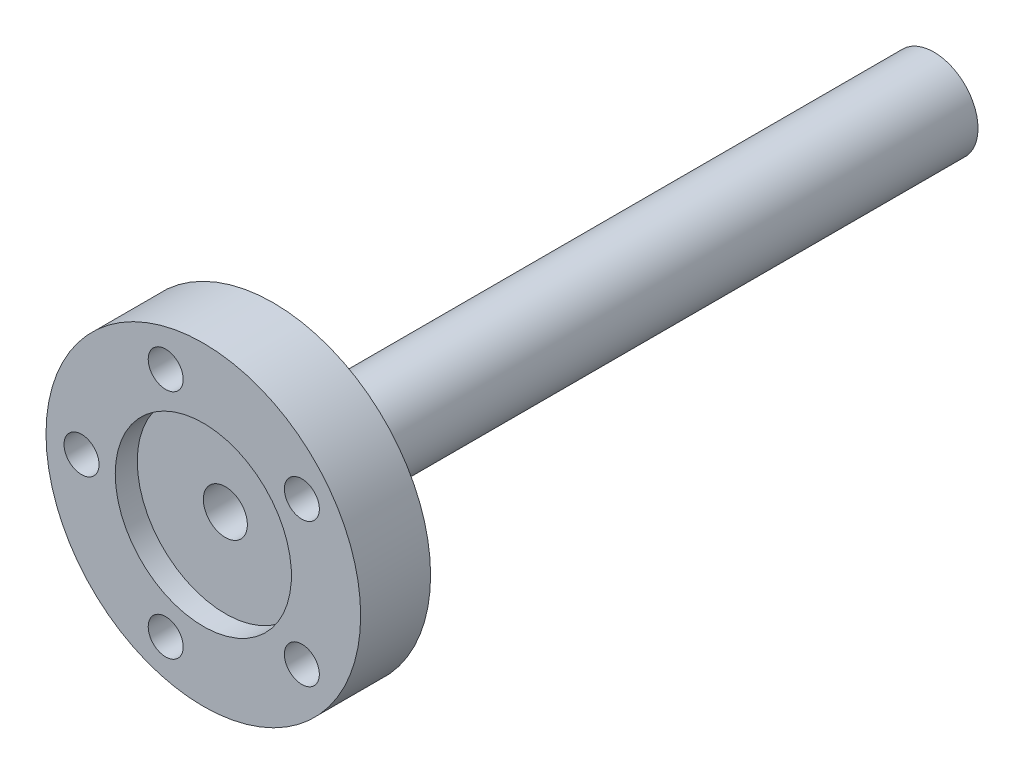
ISO-10303-21;
HEADER;
FILE_DESCRIPTION(('STEP AP214'),'2;1');
FILE_NAME('part.step','',(''),(''),'','','');
FILE_SCHEMA(('AUTOMOTIVE_DESIGN { 1 0 10303 214 1 1 1 1 }'));
ENDSEC;
DATA;
#1=APPLICATION_CONTEXT('core data for automotive mechanical design processes');
#2=APPLICATION_PROTOCOL_DEFINITION('international standard','automotive_design',2000,#1);
#3=PRODUCT_CONTEXT('',#1,'mechanical');
#4=PRODUCT('Part','Part','',(#3));
#5=PRODUCT_RELATED_PRODUCT_CATEGORY('part','',(#4));
#6=PRODUCT_DEFINITION_FORMATION('','',#4);
#7=PRODUCT_DEFINITION_CONTEXT('part definition',#1,'design');
#8=PRODUCT_DEFINITION('design','',#6,#7);
#9=PRODUCT_DEFINITION_SHAPE('','',#8);
#10=(LENGTH_UNIT() NAMED_UNIT(*) SI_UNIT(.MILLI.,.METRE.));
#11=(NAMED_UNIT(*) PLANE_ANGLE_UNIT() SI_UNIT($,.RADIAN.));
#12=(NAMED_UNIT(*) SI_UNIT($,.STERADIAN.) SOLID_ANGLE_UNIT());
#13=UNCERTAINTY_MEASURE_WITH_UNIT(LENGTH_MEASURE(1.E-05),#10,'distance_accuracy_value','');
#14=(GEOMETRIC_REPRESENTATION_CONTEXT(3) GLOBAL_UNCERTAINTY_ASSIGNED_CONTEXT((#13)) GLOBAL_UNIT_ASSIGNED_CONTEXT((#10,
#11,#12)) REPRESENTATION_CONTEXT('',''));
#15=CARTESIAN_POINT('',(0.,0.,0.));
#16=DIRECTION('',(0.,0.,1.));
#17=DIRECTION('',(1.,0.,0.));
#18=AXIS2_PLACEMENT_3D('',#15,#16,#17);
#19=CARTESIAN_POINT('',(0.,0.,-5.));
#20=DIRECTION('',(0.,0.,-1.));
#21=DIRECTION('',(-1.,0.,0.));
#22=AXIS2_PLACEMENT_3D('',#19,#20,#21);
#23=PLANE('',#22);
#24=CARTESIAN_POINT('',(0.,0.,-5.));
#25=DIRECTION('',(0.,0.,-1.));
#26=DIRECTION('',(-1.,0.,0.));
#27=AXIS2_PLACEMENT_3D('',#24,#25,#26);
#28=CIRCLE('',#27,2.);
#29=CARTESIAN_POINT('',(-2.,0.,-5.));
#30=VERTEX_POINT('',#29);
#31=EDGE_CURVE('E20',#30,#30,#28,.F.);
#32=ORIENTED_EDGE('',*,*,#31,.T.);
#33=EDGE_LOOP('',(#32));
#34=FACE_BOUND('',#33,.T.);
#35=ADVANCED_FACE('F17',(#34),#23,.F.);
#36=CARTESIAN_POINT('',(0.,0.,-2.));
#37=DIRECTION('',(0.,0.,-1.));
#38=DIRECTION('',(-1.,0.,0.));
#39=AXIS2_PLACEMENT_3D('',#36,#37,#38);
#40=CYLINDRICAL_SURFACE('',#39,2.);
#41=CARTESIAN_POINT('',(0.,0.,-2.));
#42=DIRECTION('',(0.,0.,-1.));
#43=DIRECTION('',(-1.,0.,0.));
#44=AXIS2_PLACEMENT_3D('',#41,#42,#43);
#45=CIRCLE('',#44,2.);
#46=CARTESIAN_POINT('',(-2.,0.,-2.));
#47=VERTEX_POINT('',#46);
#48=EDGE_CURVE('E308',#47,#47,#45,.F.);
#49=ORIENTED_EDGE('',*,*,#48,.T.);
#50=EDGE_LOOP('',(#49));
#51=FACE_BOUND('',#50,.T.);
#52=ORIENTED_EDGE('',*,*,#31,.F.);
#53=EDGE_LOOP('',(#52));
#54=FACE_BOUND('',#53,.T.);
#55=ADVANCED_FACE('F185',(#51,#54),#40,.F.);
#56=CARTESIAN_POINT('',(0.,0.,-2.));
#57=DIRECTION('',(0.,0.,-1.));
#58=DIRECTION('',(-1.,0.,0.));
#59=AXIS2_PLACEMENT_3D('',#56,#57,#58);
#60=PLANE('',#59);
#61=CARTESIAN_POINT('',(0.,0.,-2.));
#62=DIRECTION('',(0.,0.,-1.));
#63=DIRECTION('',(-1.,0.,0.));
#64=AXIS2_PLACEMENT_3D('',#61,#62,#63);
#65=CIRCLE('',#64,8.);
#66=CARTESIAN_POINT('',(-8.,0.,-2.));
#67=VERTEX_POINT('',#66);
#68=EDGE_CURVE('E306',#67,#67,#65,.F.);
#69=ORIENTED_EDGE('',*,*,#68,.T.);
#70=EDGE_LOOP('',(#69));
#71=FACE_BOUND('',#70,.T.);
#72=ORIENTED_EDGE('',*,*,#48,.F.);
#73=EDGE_LOOP('',(#72));
#74=FACE_BOUND('',#73,.T.);
#75=ADVANCED_FACE('F182',(#71,#74),#60,.F.);
#76=CARTESIAN_POINT('',(0.,0.,0.));
#77=DIRECTION('',(0.,0.,-1.));
#78=DIRECTION('',(-1.,0.,0.));
#79=AXIS2_PLACEMENT_3D('',#76,#77,#78);
#80=CYLINDRICAL_SURFACE('',#79,8.);
#81=CARTESIAN_POINT('',(0.,0.,0.));
#82=DIRECTION('',(0.,0.,-1.));
#83=DIRECTION('',(-1.,0.,0.));
#84=AXIS2_PLACEMENT_3D('',#81,#82,#83);
#85=CIRCLE('',#84,8.);
#86=CARTESIAN_POINT('',(-8.,0.,0.));
#87=VERTEX_POINT('',#86);
#88=EDGE_CURVE('E303',#87,#87,#85,.F.);
#89=ORIENTED_EDGE('',*,*,#88,.T.);
#90=EDGE_LOOP('',(#89));
#91=FACE_BOUND('',#90,.T.);
#92=ORIENTED_EDGE('',*,*,#68,.F.);
#93=EDGE_LOOP('',(#92));
#94=FACE_BOUND('',#93,.T.);
#95=ADVANCED_FACE('F178',(#91,#94),#80,.F.);
#96=CARTESIAN_POINT('',(-3.41772795778692,10.5186850702244,0.));
#97=DIRECTION('',(0.,0.,-1.));
#98=DIRECTION('',(-1.,0.,0.));
#99=AXIS2_PLACEMENT_3D('',#96,#97,#98);
#100=CYLINDRICAL_SURFACE('',#99,1.5875);
#101=CARTESIAN_POINT('',(-3.41772795778692,10.5186850702244,0.));
#102=DIRECTION('',(0.,0.,-1.));
#103=DIRECTION('',(-1.,0.,0.));
#104=AXIS2_PLACEMENT_3D('',#101,#102,#103);
#105=CIRCLE('',#104,1.5875);
#106=CARTESIAN_POINT('',(-5.00522795778692,10.5186850702244,0.));
#107=VERTEX_POINT('',#106);
#108=EDGE_CURVE('E291',#107,#107,#105,.F.);
#109=ORIENTED_EDGE('',*,*,#108,.T.);
#110=EDGE_LOOP('',(#109));
#111=FACE_BOUND('',#110,.T.);
#112=CARTESIAN_POINT('',(-3.41772795778692,10.5186850702244,-4.7625));
#113=DIRECTION('',(0.,0.,-1.));
#114=DIRECTION('',(-1.,0.,0.));
#115=AXIS2_PLACEMENT_3D('',#112,#113,#114);
#116=CIRCLE('',#115,1.5875);
#117=CARTESIAN_POINT('',(-5.00522795778692,10.5186850702244,-4.7625));
#118=VERTEX_POINT('',#117);
#119=EDGE_CURVE('E285',#118,#118,#116,.T.);
#120=ORIENTED_EDGE('',*,*,#119,.T.);
#121=EDGE_LOOP('',(#120));
#122=FACE_BOUND('',#121,.T.);
#123=ADVANCED_FACE('F174',(#111,#122),#100,.F.);
#124=CARTESIAN_POINT('',(8.94772795778692,6.50090489035475,0.));
#125=DIRECTION('',(0.,0.,-1.));
#126=DIRECTION('',(-1.,0.,0.));
#127=AXIS2_PLACEMENT_3D('',#124,#125,#126);
#128=CYLINDRICAL_SURFACE('',#127,1.5875);
#129=CARTESIAN_POINT('',(8.94772795778692,6.50090489035475,0.));
#130=DIRECTION('',(0.,0.,-1.));
#131=DIRECTION('',(-1.,0.,0.));
#132=AXIS2_PLACEMENT_3D('',#129,#130,#131);
#133=CIRCLE('',#132,1.5875);
#134=CARTESIAN_POINT('',(7.36022795778692,6.50090489035475,0.));
#135=VERTEX_POINT('',#134);
#136=EDGE_CURVE('E294',#135,#135,#133,.F.);
#137=ORIENTED_EDGE('',*,*,#136,.T.);
#138=EDGE_LOOP('',(#137));
#139=FACE_BOUND('',#138,.T.);
#140=CARTESIAN_POINT('',(8.94772795778692,6.50090489035475,-4.7625));
#141=DIRECTION('',(0.,0.,-1.));
#142=DIRECTION('',(-1.,0.,0.));
#143=AXIS2_PLACEMENT_3D('',#140,#141,#142);
#144=CIRCLE('',#143,1.5875);
#145=CARTESIAN_POINT('',(7.36022795778692,6.50090489035475,-4.7625));
#146=VERTEX_POINT('',#145);
#147=EDGE_CURVE('E282',#146,#146,#144,.T.);
#148=ORIENTED_EDGE('',*,*,#147,.T.);
#149=EDGE_LOOP('',(#148));
#150=FACE_BOUND('',#149,.T.);
#151=ADVANCED_FACE('F170',(#139,#150),#128,.F.);
#152=CARTESIAN_POINT('',(8.94772795778692,-6.50090489035475,0.));
#153=DIRECTION('',(0.,0.,-1.));
#154=DIRECTION('',(-1.,0.,0.));
#155=AXIS2_PLACEMENT_3D('',#152,#153,#154);
#156=CYLINDRICAL_SURFACE('',#155,1.5875);
#157=CARTESIAN_POINT('',(8.94772795778692,-6.50090489035475,0.));
#158=DIRECTION('',(0.,0.,-1.));
#159=DIRECTION('',(-1.,0.,0.));
#160=AXIS2_PLACEMENT_3D('',#157,#158,#159);
#161=CIRCLE('',#160,1.5875);
#162=CARTESIAN_POINT('',(7.36022795778692,-6.50090489035475,0.));
#163=VERTEX_POINT('',#162);
#164=EDGE_CURVE('E297',#163,#163,#161,.F.);
#165=ORIENTED_EDGE('',*,*,#164,.T.);
#166=EDGE_LOOP('',(#165));
#167=FACE_BOUND('',#166,.T.);
#168=CARTESIAN_POINT('',(8.94772795778692,-6.50090489035475,-4.7625));
#169=DIRECTION('',(0.,0.,-1.));
#170=DIRECTION('',(-1.,0.,0.));
#171=AXIS2_PLACEMENT_3D('',#168,#169,#170);
#172=CIRCLE('',#171,1.5875);
#173=CARTESIAN_POINT('',(7.36022795778692,-6.50090489035475,-4.7625));
#174=VERTEX_POINT('',#173);
#175=EDGE_CURVE('E279',#174,#174,#172,.T.);
#176=ORIENTED_EDGE('',*,*,#175,.T.);
#177=EDGE_LOOP('',(#176));
#178=FACE_BOUND('',#177,.T.);
#179=ADVANCED_FACE('F166',(#167,#178),#156,.F.);
#180=CARTESIAN_POINT('',(-3.41772795778692,-10.5186850702244,0.));
#181=DIRECTION('',(0.,0.,-1.));
#182=DIRECTION('',(-1.,0.,0.));
#183=AXIS2_PLACEMENT_3D('',#180,#181,#182);
#184=CYLINDRICAL_SURFACE('',#183,1.5875);
#185=CARTESIAN_POINT('',(-3.41772795778692,-10.5186850702244,0.));
#186=DIRECTION('',(0.,0.,-1.));
#187=DIRECTION('',(-1.,0.,0.));
#188=AXIS2_PLACEMENT_3D('',#185,#186,#187);
#189=CIRCLE('',#188,1.5875);
#190=CARTESIAN_POINT('',(-5.00522795778692,-10.5186850702244,0.));
#191=VERTEX_POINT('',#190);
#192=EDGE_CURVE('E300',#191,#191,#189,.F.);
#193=ORIENTED_EDGE('',*,*,#192,.T.);
#194=EDGE_LOOP('',(#193));
#195=FACE_BOUND('',#194,.T.);
#196=CARTESIAN_POINT('',(-3.41772795778692,-10.5186850702244,-4.7625));
#197=DIRECTION('',(0.,0.,-1.));
#198=DIRECTION('',(-1.,0.,0.));
#199=AXIS2_PLACEMENT_3D('',#196,#197,#198);
#200=CIRCLE('',#199,1.5875);
#201=CARTESIAN_POINT('',(-5.00522795778692,-10.5186850702244,-4.7625));
#202=VERTEX_POINT('',#201);
#203=EDGE_CURVE('E276',#202,#202,#200,.T.);
#204=ORIENTED_EDGE('',*,*,#203,.T.);
#205=EDGE_LOOP('',(#204));
#206=FACE_BOUND('',#205,.T.);
#207=ADVANCED_FACE('F162',(#195,#206),#184,.F.);
#208=CARTESIAN_POINT('',(-11.06,0.,0.));
#209=DIRECTION('',(0.,0.,-1.));
#210=DIRECTION('',(-1.,0.,0.));
#211=AXIS2_PLACEMENT_3D('',#208,#209,#210);
#212=CYLINDRICAL_SURFACE('',#211,1.5875);
#213=CARTESIAN_POINT('',(-11.06,0.,0.));
#214=DIRECTION('',(0.,0.,-1.));
#215=DIRECTION('',(-1.,0.,0.));
#216=AXIS2_PLACEMENT_3D('',#213,#214,#215);
#217=CIRCLE('',#216,1.5875);
#218=CARTESIAN_POINT('',(-12.6475,0.,0.));
#219=VERTEX_POINT('',#218);
#220=EDGE_CURVE('E288',#219,#219,#217,.F.);
#221=ORIENTED_EDGE('',*,*,#220,.T.);
#222=EDGE_LOOP('',(#221));
#223=FACE_BOUND('',#222,.T.);
#224=CARTESIAN_POINT('',(-11.06,0.,-4.7625));
#225=DIRECTION('',(0.,0.,-1.));
#226=DIRECTION('',(-1.,0.,0.));
#227=AXIS2_PLACEMENT_3D('',#224,#225,#226);
#228=CIRCLE('',#227,1.5875);
#229=CARTESIAN_POINT('',(-12.6475,0.,-4.7625));
#230=VERTEX_POINT('',#229);
#231=EDGE_CURVE('E273',#230,#230,#228,.T.);
#232=ORIENTED_EDGE('',*,*,#231,.T.);
#233=EDGE_LOOP('',(#232));
#234=FACE_BOUND('',#233,.T.);
#235=ADVANCED_FACE('F158',(#223,#234),#212,.F.);
#236=CARTESIAN_POINT('',(0.,0.,0.));
#237=DIRECTION('',(0.,0.,-1.));
#238=DIRECTION('',(-1.,0.,0.));
#239=AXIS2_PLACEMENT_3D('',#236,#237,#238);
#240=PLANE('',#239);
#241=CARTESIAN_POINT('',(0.,0.,0.));
#242=DIRECTION('',(0.,0.,1.));
#243=DIRECTION('',(1.,0.,0.));
#244=AXIS2_PLACEMENT_3D('',#241,#242,#243);
#245=CIRCLE('',#244,14.2875);
#246=CARTESIAN_POINT('',(14.2875,0.,0.));
#247=VERTEX_POINT('',#246);
#248=EDGE_CURVE('E270',#247,#247,#245,.F.);
#249=ORIENTED_EDGE('',*,*,#248,.F.);
#250=EDGE_LOOP('',(#249));
#251=FACE_BOUND('',#250,.T.);
#252=ORIENTED_EDGE('',*,*,#220,.F.);
#253=EDGE_LOOP('',(#252));
#254=FACE_BOUND('',#253,.T.);
#255=ORIENTED_EDGE('',*,*,#108,.F.);
#256=EDGE_LOOP('',(#255));
#257=FACE_BOUND('',#256,.T.);
#258=ORIENTED_EDGE('',*,*,#136,.F.);
#259=EDGE_LOOP('',(#258));
#260=FACE_BOUND('',#259,.T.);
#261=ORIENTED_EDGE('',*,*,#164,.F.);
#262=EDGE_LOOP('',(#261));
#263=FACE_BOUND('',#262,.T.);
#264=ORIENTED_EDGE('',*,*,#192,.F.);
#265=EDGE_LOOP('',(#264));
#266=FACE_BOUND('',#265,.T.);
#267=ORIENTED_EDGE('',*,*,#88,.F.);
#268=EDGE_LOOP('',(#267));
#269=FACE_BOUND('',#268,.T.);
#270=ADVANCED_FACE('F154',(#251,#254,#257,#260,#263,#266,#269),#240,.F.);
#271=CARTESIAN_POINT('',(-3.41772795778692,10.5186850702244,-4.7625));
#272=DIRECTION('',(0.,0.,-1.));
#273=DIRECTION('',(-1.,0.,0.));
#274=AXIS2_PLACEMENT_3D('',#271,#272,#273);
#275=PLANE('',#274);
#276=ORIENTED_EDGE('',*,*,#119,.F.);
#277=EDGE_LOOP('',(#276));
#278=FACE_BOUND('',#277,.T.);
#279=CARTESIAN_POINT('',(-3.41772795778692,10.5186850702244,-4.7625));
#280=DIRECTION('',(0.,0.,1.));
#281=DIRECTION('',(1.,0.,0.));
#282=AXIS2_PLACEMENT_3D('',#279,#280,#281);
#283=CIRCLE('',#282,1.0922);
#284=CARTESIAN_POINT('',(-2.32552795778692,10.5186850702244,-4.7625));
#285=VERTEX_POINT('',#284);
#286=EDGE_CURVE('E267',#285,#285,#283,.F.);
#287=ORIENTED_EDGE('',*,*,#286,.T.);
#288=EDGE_LOOP('',(#287));
#289=FACE_BOUND('',#288,.T.);
#290=ADVANCED_FACE('F150',(#278,#289),#275,.F.);
#291=CARTESIAN_POINT('',(8.94772795778692,6.50090489035475,-4.7625));
#292=DIRECTION('',(0.,0.,-1.));
#293=DIRECTION('',(-1.,0.,0.));
#294=AXIS2_PLACEMENT_3D('',#291,#292,#293);
#295=PLANE('',#294);
#296=ORIENTED_EDGE('',*,*,#147,.F.);
#297=EDGE_LOOP('',(#296));
#298=FACE_BOUND('',#297,.T.);
#299=CARTESIAN_POINT('',(8.94772795778692,6.50090489035475,-4.7625));
#300=DIRECTION('',(0.,0.,1.));
#301=DIRECTION('',(1.,0.,0.));
#302=AXIS2_PLACEMENT_3D('',#299,#300,#301);
#303=CIRCLE('',#302,1.0922);
#304=CARTESIAN_POINT('',(10.0399279577869,6.50090489035475,-4.7625));
#305=VERTEX_POINT('',#304);
#306=EDGE_CURVE('E264',#305,#305,#303,.F.);
#307=ORIENTED_EDGE('',*,*,#306,.T.);
#308=EDGE_LOOP('',(#307));
#309=FACE_BOUND('',#308,.T.);
#310=ADVANCED_FACE('F146',(#298,#309),#295,.F.);
#311=CARTESIAN_POINT('',(8.94772795778692,-6.50090489035475,-4.7625));
#312=DIRECTION('',(0.,0.,-1.));
#313=DIRECTION('',(-1.,0.,0.));
#314=AXIS2_PLACEMENT_3D('',#311,#312,#313);
#315=PLANE('',#314);
#316=ORIENTED_EDGE('',*,*,#175,.F.);
#317=EDGE_LOOP('',(#316));
#318=FACE_BOUND('',#317,.T.);
#319=CARTESIAN_POINT('',(8.94772795778692,-6.50090489035475,-4.7625));
#320=DIRECTION('',(0.,0.,1.));
#321=DIRECTION('',(1.,0.,0.));
#322=AXIS2_PLACEMENT_3D('',#319,#320,#321);
#323=CIRCLE('',#322,1.0922);
#324=CARTESIAN_POINT('',(10.0399279577869,-6.50090489035475,-4.7625));
#325=VERTEX_POINT('',#324);
#326=EDGE_CURVE('E261',#325,#325,#323,.F.);
#327=ORIENTED_EDGE('',*,*,#326,.T.);
#328=EDGE_LOOP('',(#327));
#329=FACE_BOUND('',#328,.T.);
#330=ADVANCED_FACE('F142',(#318,#329),#315,.F.);
#331=CARTESIAN_POINT('',(-3.41772795778692,-10.5186850702244,-4.7625));
#332=DIRECTION('',(0.,0.,-1.));
#333=DIRECTION('',(-1.,0.,0.));
#334=AXIS2_PLACEMENT_3D('',#331,#332,#333);
#335=PLANE('',#334);
#336=ORIENTED_EDGE('',*,*,#203,.F.);
#337=EDGE_LOOP('',(#336));
#338=FACE_BOUND('',#337,.T.);
#339=CARTESIAN_POINT('',(-3.41772795778692,-10.5186850702244,-4.7625));
#340=DIRECTION('',(0.,0.,1.));
#341=DIRECTION('',(1.,0.,0.));
#342=AXIS2_PLACEMENT_3D('',#339,#340,#341);
#343=CIRCLE('',#342,1.0922);
#344=CARTESIAN_POINT('',(-2.32552795778692,-10.5186850702244,-4.7625));
#345=VERTEX_POINT('',#344);
#346=EDGE_CURVE('E258',#345,#345,#343,.F.);
#347=ORIENTED_EDGE('',*,*,#346,.T.);
#348=EDGE_LOOP('',(#347));
#349=FACE_BOUND('',#348,.T.);
#350=ADVANCED_FACE('F138',(#338,#349),#335,.F.);
#351=CARTESIAN_POINT('',(-11.06,0.,-4.7625));
#352=DIRECTION('',(0.,0.,-1.));
#353=DIRECTION('',(-1.,0.,0.));
#354=AXIS2_PLACEMENT_3D('',#351,#352,#353);
#355=PLANE('',#354);
#356=CARTESIAN_POINT('',(-11.06,0.,-4.7625));
#357=DIRECTION('',(0.,0.,-1.));
#358=DIRECTION('',(-1.,0.,0.));
#359=AXIS2_PLACEMENT_3D('',#356,#357,#358);
#360=CIRCLE('',#359,1.5367);
#361=CARTESIAN_POINT('',(-12.5967,0.,-4.7625));
#362=VERTEX_POINT('',#361);
#363=EDGE_CURVE('E255',#362,#362,#360,.T.);
#364=ORIENTED_EDGE('',*,*,#363,.T.);
#365=EDGE_LOOP('',(#364));
#366=FACE_BOUND('',#365,.T.);
#367=ORIENTED_EDGE('',*,*,#231,.F.);
#368=EDGE_LOOP('',(#367));
#369=FACE_BOUND('',#368,.T.);
#370=ADVANCED_FACE('F134',(#366,#369),#355,.F.);
#371=CARTESIAN_POINT('',(0.,0.,-6.35));
#372=DIRECTION('',(0.,0.,1.));
#373=DIRECTION('',(1.,0.,0.));
#374=AXIS2_PLACEMENT_3D('',#371,#372,#373);
#375=CYLINDRICAL_SURFACE('',#374,14.2875);
#376=ORIENTED_EDGE('',*,*,#248,.T.);
#377=EDGE_LOOP('',(#376));
#378=FACE_BOUND('',#377,.T.);
#379=CARTESIAN_POINT('',(0.,0.,-6.35));
#380=DIRECTION('',(0.,0.,1.));
#381=DIRECTION('',(1.,0.,0.));
#382=AXIS2_PLACEMENT_3D('',#379,#380,#381);
#383=CIRCLE('',#382,14.2875);
#384=CARTESIAN_POINT('',(14.2875,0.,-6.35));
#385=VERTEX_POINT('',#384);
#386=EDGE_CURVE('E252',#385,#385,#383,.F.);
#387=ORIENTED_EDGE('',*,*,#386,.F.);
#388=EDGE_LOOP('',(#387));
#389=FACE_BOUND('',#388,.T.);
#390=ADVANCED_FACE('F130',(#378,#389),#375,.T.);
#391=CARTESIAN_POINT('',(-3.41772795778692,10.5186850702244,-82.4502323005377));
#392=DIRECTION('',(0.,0.,1.));
#393=DIRECTION('',(1.,0.,0.));
#394=AXIS2_PLACEMENT_3D('',#391,#392,#393);
#395=CYLINDRICAL_SURFACE('',#394,1.0922);
#396=CARTESIAN_POINT('',(-3.41772795778692,10.5186850702244,-6.34999999999999));
#397=DIRECTION('',(0.,0.,1.));
#398=DIRECTION('',(1.,0.,0.));
#399=AXIS2_PLACEMENT_3D('',#396,#397,#398);
#400=CIRCLE('',#399,1.0922);
#401=CARTESIAN_POINT('',(-2.32552795778692,10.5186850702244,-6.34999999999999));
#402=VERTEX_POINT('',#401);
#403=EDGE_CURVE('E249',#402,#402,#400,.T.);
#404=ORIENTED_EDGE('',*,*,#403,.F.);
#405=EDGE_LOOP('',(#404));
#406=FACE_BOUND('',#405,.T.);
#407=ORIENTED_EDGE('',*,*,#286,.F.);
#408=EDGE_LOOP('',(#407));
#409=FACE_BOUND('',#408,.T.);
#410=ADVANCED_FACE('F126',(#406,#409),#395,.F.);
#411=CARTESIAN_POINT('',(8.94772795778692,6.50090489035475,-82.4502323005377));
#412=DIRECTION('',(0.,0.,1.));
#413=DIRECTION('',(1.,0.,0.));
#414=AXIS2_PLACEMENT_3D('',#411,#412,#413);
#415=CYLINDRICAL_SURFACE('',#414,1.0922);
#416=CARTESIAN_POINT('',(8.94772795778692,6.50090489035475,-6.34999999999999));
#417=DIRECTION('',(0.,0.,1.));
#418=DIRECTION('',(1.,0.,0.));
#419=AXIS2_PLACEMENT_3D('',#416,#417,#418);
#420=CIRCLE('',#419,1.0922);
#421=CARTESIAN_POINT('',(10.0399279577869,6.50090489035475,-6.34999999999999));
#422=VERTEX_POINT('',#421);
#423=EDGE_CURVE('E246',#422,#422,#420,.T.);
#424=ORIENTED_EDGE('',*,*,#423,.F.);
#425=EDGE_LOOP('',(#424));
#426=FACE_BOUND('',#425,.T.);
#427=ORIENTED_EDGE('',*,*,#306,.F.);
#428=EDGE_LOOP('',(#427));
#429=FACE_BOUND('',#428,.T.);
#430=ADVANCED_FACE('F122',(#426,#429),#415,.F.);
#431=CARTESIAN_POINT('',(8.94772795778692,-6.50090489035475,-82.4502323005377));
#432=DIRECTION('',(0.,0.,1.));
#433=DIRECTION('',(1.,0.,0.));
#434=AXIS2_PLACEMENT_3D('',#431,#432,#433);
#435=CYLINDRICAL_SURFACE('',#434,1.0922);
#436=CARTESIAN_POINT('',(8.94772795778692,-6.50090489035475,-6.34999999999999));
#437=DIRECTION('',(0.,0.,1.));
#438=DIRECTION('',(1.,0.,0.));
#439=AXIS2_PLACEMENT_3D('',#436,#437,#438);
#440=CIRCLE('',#439,1.0922);
#441=CARTESIAN_POINT('',(10.0399279577869,-6.50090489035475,-6.34999999999999));
#442=VERTEX_POINT('',#441);
#443=EDGE_CURVE('E243',#442,#442,#440,.T.);
#444=ORIENTED_EDGE('',*,*,#443,.F.);
#445=EDGE_LOOP('',(#444));
#446=FACE_BOUND('',#445,.T.);
#447=ORIENTED_EDGE('',*,*,#326,.F.);
#448=EDGE_LOOP('',(#447));
#449=FACE_BOUND('',#448,.T.);
#450=ADVANCED_FACE('F118',(#446,#449),#435,.F.);
#451=CARTESIAN_POINT('',(-3.41772795778692,-10.5186850702244,-82.4502323005377));
#452=DIRECTION('',(0.,0.,1.));
#453=DIRECTION('',(1.,0.,0.));
#454=AXIS2_PLACEMENT_3D('',#451,#452,#453);
#455=CYLINDRICAL_SURFACE('',#454,1.0922);
#456=CARTESIAN_POINT('',(-3.41772795778692,-10.5186850702244,-6.34999999999999));
#457=DIRECTION('',(0.,0.,1.));
#458=DIRECTION('',(1.,0.,0.));
#459=AXIS2_PLACEMENT_3D('',#456,#457,#458);
#460=CIRCLE('',#459,1.0922);
#461=CARTESIAN_POINT('',(-2.32552795778692,-10.5186850702244,-6.34999999999999));
#462=VERTEX_POINT('',#461);
#463=EDGE_CURVE('E240',#462,#462,#460,.T.);
#464=ORIENTED_EDGE('',*,*,#463,.F.);
#465=EDGE_LOOP('',(#464));
#466=FACE_BOUND('',#465,.T.);
#467=ORIENTED_EDGE('',*,*,#346,.F.);
#468=EDGE_LOOP('',(#467));
#469=FACE_BOUND('',#468,.T.);
#470=ADVANCED_FACE('F114',(#466,#469),#455,.F.);
#471=CARTESIAN_POINT('',(-11.06,0.,-77.6877323005376));
#472=DIRECTION('',(0.,0.,-1.));
#473=DIRECTION('',(-1.,0.,0.));
#474=AXIS2_PLACEMENT_3D('',#471,#472,#473);
#475=CYLINDRICAL_SURFACE('',#474,1.5367);
#476=CARTESIAN_POINT('',(-11.06,0.,-6.34999999999999));
#477=DIRECTION('',(0.,0.,-1.));
#478=DIRECTION('',(-1.,0.,0.));
#479=AXIS2_PLACEMENT_3D('',#476,#477,#478);
#480=CIRCLE('',#479,1.5367);
#481=CARTESIAN_POINT('',(-12.5967,0.,-6.34999999999999));
#482=VERTEX_POINT('',#481);
#483=EDGE_CURVE('E237',#482,#482,#480,.F.);
#484=ORIENTED_EDGE('',*,*,#483,.F.);
#485=EDGE_LOOP('',(#484));
#486=FACE_BOUND('',#485,.T.);
#487=ORIENTED_EDGE('',*,*,#363,.F.);
#488=EDGE_LOOP('',(#487));
#489=FACE_BOUND('',#488,.T.);
#490=ADVANCED_FACE('F110',(#486,#489),#475,.F.);
#491=CARTESIAN_POINT('',(-0.999999999999987,-3.,-34.346));
#492=DIRECTION('',(0.,1.,0.));
#493=DIRECTION('',(0.,0.,1.));
#494=AXIS2_PLACEMENT_3D('',#491,#492,#493);
#495=PLANE('',#494);
#496=DIRECTION('',(0.,0.,-1.));
#497=VECTOR('',#496,1.);
#498=CARTESIAN_POINT('',(1.,-3.,-34.346));
#499=LINE('',#498,#497);
#500=CARTESIAN_POINT('',(1.,-3.,-66.35));
#501=VERTEX_POINT('',#500);
#502=CARTESIAN_POINT('',(1.,-3.,-34.346));
#503=VERTEX_POINT('',#502);
#504=EDGE_CURVE('E82',#501,#503,#499,.F.);
#505=ORIENTED_EDGE('',*,*,#504,.T.);
#506=DIRECTION('',(-1.,0.,0.));
#507=VECTOR('',#506,1.);
#508=CARTESIAN_POINT('',(-0.999999999999987,-3.,-34.346));
#509=LINE('',#508,#507);
#510=CARTESIAN_POINT('',(-0.999999999999987,-3.,-34.346));
#511=VERTEX_POINT('',#510);
#512=EDGE_CURVE('E61',#511,#503,#509,.F.);
#513=ORIENTED_EDGE('',*,*,#512,.F.);
#514=DIRECTION('',(0.,0.,1.));
#515=VECTOR('',#514,1.);
#516=CARTESIAN_POINT('',(-0.999999999999988,-3.,-34.346));
#517=LINE('',#516,#515);
#518=CARTESIAN_POINT('',(-0.999999999999987,-3.,-66.35));
#519=VERTEX_POINT('',#518);
#520=EDGE_CURVE('E57',#511,#519,#517,.F.);
#521=ORIENTED_EDGE('',*,*,#520,.T.);
#522=DIRECTION('',(1.,0.,0.));
#523=VECTOR('',#522,1.);
#524=CARTESIAN_POINT('',(0.,-3.,-66.35));
#525=LINE('',#524,#523);
#526=EDGE_CURVE('E77',#519,#501,#525,.T.);
#527=ORIENTED_EDGE('',*,*,#526,.T.);
#528=EDGE_LOOP('',(#505,#513,#521,#527));
#529=FACE_BOUND('',#528,.T.);
#530=ADVANCED_FACE('F105',(#529),#495,.F.);
#531=CARTESIAN_POINT('',(0.,0.,-6.35));
#532=DIRECTION('',(0.,0.,-1.));
#533=DIRECTION('',(-1.,0.,0.));
#534=AXIS2_PLACEMENT_3D('',#531,#532,#533);
#535=PLANE('',#534);
#536=ORIENTED_EDGE('',*,*,#483,.T.);
#537=EDGE_LOOP('',(#536));
#538=FACE_BOUND('',#537,.T.);
#539=ORIENTED_EDGE('',*,*,#463,.T.);
#540=EDGE_LOOP('',(#539));
#541=FACE_BOUND('',#540,.T.);
#542=ORIENTED_EDGE('',*,*,#443,.T.);
#543=EDGE_LOOP('',(#542));
#544=FACE_BOUND('',#543,.T.);
#545=ORIENTED_EDGE('',*,*,#423,.T.);
#546=EDGE_LOOP('',(#545));
#547=FACE_BOUND('',#546,.T.);
#548=ORIENTED_EDGE('',*,*,#403,.T.);
#549=EDGE_LOOP('',(#548));
#550=FACE_BOUND('',#549,.T.);
#551=CARTESIAN_POINT('',(0.,0.,-6.35));
#552=DIRECTION('',(0.,0.,-1.));
#553=DIRECTION('',(-1.,0.,0.));
#554=AXIS2_PLACEMENT_3D('',#551,#552,#553);
#555=CIRCLE('',#554,4.7874);
#556=CARTESIAN_POINT('',(-4.7874,0.,-6.35));
#557=VERTEX_POINT('',#556);
#558=EDGE_CURVE('E74',#557,#557,#555,.F.);
#559=ORIENTED_EDGE('',*,*,#558,.T.);
#560=EDGE_LOOP('',(#559));
#561=FACE_BOUND('',#560,.T.);
#562=ORIENTED_EDGE('',*,*,#386,.T.);
#563=EDGE_LOOP('',(#562));
#564=FACE_BOUND('',#563,.T.);
#565=ADVANCED_FACE('F95',(#538,#541,#544,#547,#550,#561,#564),#535,.T.);
#566=CARTESIAN_POINT('',(-0.999999999999988,-4.3012987012987,-34.346));
#567=DIRECTION('',(-1.,0.,0.));
#568=DIRECTION('',(0.,-1.,0.));
#569=AXIS2_PLACEMENT_3D('',#566,#567,#568);
#570=PLANE('',#569);
#571=DIRECTION('',(0.,1.,0.));
#572=VECTOR('',#571,1.);
#573=CARTESIAN_POINT('',(-0.999999999999987,0.,-66.35));
#574=LINE('',#573,#572);
#575=CARTESIAN_POINT('',(-0.999999999999987,-3.87298334620742,-66.35));
#576=VERTEX_POINT('',#575);
#577=EDGE_CURVE('E214',#576,#519,#574,.T.);
#578=ORIENTED_EDGE('',*,*,#577,.T.);
#579=ORIENTED_EDGE('',*,*,#520,.F.);
#580=DIRECTION('',(0.,1.,0.));
#581=VECTOR('',#580,1.);
#582=CARTESIAN_POINT('',(-0.999999999999987,-3.,-34.346));
#583=LINE('',#582,#581);
#584=CARTESIAN_POINT('',(-0.999999999999987,-3.87298334620742,-34.346));
#585=VERTEX_POINT('',#584);
#586=EDGE_CURVE('E49',#585,#511,#583,.T.);
#587=ORIENTED_EDGE('',*,*,#586,.F.);
#588=DIRECTION('',(0.,0.,1.));
#589=VECTOR('',#588,1.);
#590=CARTESIAN_POINT('',(-0.999999999999988,-3.87298334620742,-66.35));
#591=LINE('',#590,#589);
#592=EDGE_CURVE('E54',#576,#585,#591,.T.);
#593=ORIENTED_EDGE('',*,*,#592,.F.);
#594=EDGE_LOOP('',(#578,#579,#587,#593));
#595=FACE_BOUND('',#594,.T.);
#596=ADVANCED_FACE('F52',(#595),#570,.F.);
#597=CARTESIAN_POINT('',(-0.999999999999987,-3.,-34.346));
#598=DIRECTION('',(0.,0.,-1.));
#599=DIRECTION('',(-1.,0.,0.));
#600=AXIS2_PLACEMENT_3D('',#597,#598,#599);
#601=PLANE('',#600);
#602=DIRECTION('',(0.,1.,0.));
#603=VECTOR('',#602,1.);
#604=CARTESIAN_POINT('',(1.,-3.,-34.346));
#605=LINE('',#604,#603);
#606=CARTESIAN_POINT('',(1.,-3.87298334620742,-34.346));
#607=VERTEX_POINT('',#606);
#608=EDGE_CURVE('E67',#503,#607,#605,.F.);
#609=ORIENTED_EDGE('',*,*,#608,.T.);
#610=CARTESIAN_POINT('',(0.,0.,-34.346));
#611=DIRECTION('',(0.,0.,1.));
#612=DIRECTION('',(1.,0.,0.));
#613=AXIS2_PLACEMENT_3D('',#610,#611,#612);
#614=CIRCLE('',#613,4.);
#615=EDGE_CURVE('E64',#585,#607,#614,.T.);
#616=ORIENTED_EDGE('',*,*,#615,.F.);
#617=ORIENTED_EDGE('',*,*,#586,.T.);
#618=ORIENTED_EDGE('',*,*,#512,.T.);
#619=EDGE_LOOP('',(#609,#616,#617,#618));
#620=FACE_BOUND('',#619,.T.);
#621=ADVANCED_FACE('F65',(#620),#601,.T.);
#622=CARTESIAN_POINT('',(1.,-3.,-34.346));
#623=DIRECTION('',(1.,0.,0.));
#624=DIRECTION('',(0.,0.,-1.));
#625=AXIS2_PLACEMENT_3D('',#622,#623,#624);
#626=PLANE('',#625);
#627=ORIENTED_EDGE('',*,*,#608,.F.);
#628=ORIENTED_EDGE('',*,*,#504,.F.);
#629=DIRECTION('',(0.,1.,0.));
#630=VECTOR('',#629,1.);
#631=CARTESIAN_POINT('',(1.,0.,-66.35));
#632=LINE('',#631,#630);
#633=CARTESIAN_POINT('',(1.,-3.87298334620742,-66.35));
#634=VERTEX_POINT('',#633);
#635=EDGE_CURVE('E34',#501,#634,#632,.F.);
#636=ORIENTED_EDGE('',*,*,#635,.T.);
#637=DIRECTION('',(0.,0.,1.));
#638=VECTOR('',#637,1.);
#639=CARTESIAN_POINT('',(1.,-3.87298334620742,-66.35));
#640=LINE('',#639,#638);
#641=EDGE_CURVE('E70',#607,#634,#640,.F.);
#642=ORIENTED_EDGE('',*,*,#641,.F.);
#643=EDGE_LOOP('',(#627,#628,#636,#642));
#644=FACE_BOUND('',#643,.T.);
#645=ADVANCED_FACE('F375',(#644),#626,.F.);
#646=CARTESIAN_POINT('',(0.,0.,-66.35));
#647=DIRECTION('',(0.,0.,1.));
#648=DIRECTION('',(1.,0.,0.));
#649=AXIS2_PLACEMENT_3D('',#646,#647,#648);
#650=PLANE('',#649);
#651=ORIENTED_EDGE('',*,*,#577,.F.);
#652=CARTESIAN_POINT('',(0.,0.,-66.35));
#653=DIRECTION('',(0.,0.,1.));
#654=DIRECTION('',(1.,0.,0.));
#655=AXIS2_PLACEMENT_3D('',#652,#653,#654);
#656=CIRCLE('',#655,4.);
#657=EDGE_CURVE('E26',#634,#576,#656,.T.);
#658=ORIENTED_EDGE('',*,*,#657,.F.);
#659=ORIENTED_EDGE('',*,*,#635,.F.);
#660=ORIENTED_EDGE('',*,*,#526,.F.);
#661=EDGE_LOOP('',(#651,#658,#659,#660));
#662=FACE_BOUND('',#661,.T.);
#663=ADVANCED_FACE('F203',(#662),#650,.F.);
#664=CARTESIAN_POINT('',(0.,0.,-7.1374));
#665=DIRECTION('',(0.,0.,-1.));
#666=DIRECTION('',(-1.,0.,0.));
#667=AXIS2_PLACEMENT_3D('',#664,#665,#666);
#668=TOROIDAL_SURFACE('',#667,4.7874,0.7874);
#669=CARTESIAN_POINT('',(0.,0.,-7.1374));
#670=DIRECTION('',(0.,0.,1.));
#671=DIRECTION('',(1.,0.,0.));
#672=AXIS2_PLACEMENT_3D('',#669,#670,#671);
#673=CIRCLE('',#672,4.);
#674=CARTESIAN_POINT('',(4.,0.,-7.1374));
#675=VERTEX_POINT('',#674);
#676=EDGE_CURVE('E11',#675,#675,#673,.F.);
#677=ORIENTED_EDGE('',*,*,#676,.F.);
#678=EDGE_LOOP('',(#677));
#679=FACE_BOUND('',#678,.T.);
#680=ORIENTED_EDGE('',*,*,#558,.F.);
#681=EDGE_LOOP('',(#680));
#682=FACE_BOUND('',#681,.T.);
#683=ADVANCED_FACE('F197',(#679,#682),#668,.F.);
#684=CARTESIAN_POINT('',(0.,0.,-66.35));
#685=DIRECTION('',(0.,0.,1.));
#686=DIRECTION('',(1.,0.,0.));
#687=AXIS2_PLACEMENT_3D('',#684,#685,#686);
#688=CYLINDRICAL_SURFACE('',#687,4.);
#689=ORIENTED_EDGE('',*,*,#676,.T.);
#690=EDGE_LOOP('',(#689));
#691=FACE_BOUND('',#690,.T.);
#692=ORIENTED_EDGE('',*,*,#641,.T.);
#693=ORIENTED_EDGE('',*,*,#657,.T.);
#694=ORIENTED_EDGE('',*,*,#592,.T.);
#695=ORIENTED_EDGE('',*,*,#615,.T.);
#696=EDGE_LOOP('',(#692,#693,#694,#695));
#697=FACE_BOUND('',#696,.T.);
#698=ADVANCED_FACE('F73',(#691,#697),#688,.T.);
#699=CLOSED_SHELL('',(#35,#55,#75,#95,#123,#151,#179,#207,#235,#270,#290,#310,#330,#350,#370,
#390,#410,#430,#450,#470,#490,#530,#565,#596,#621,#645,#663,#683,#698));
#700=MANIFOLD_SOLID_BREP('B1',#699);
#701=ADVANCED_BREP_SHAPE_REPRESENTATION('',(#18,#700),#14);
#702=SHAPE_DEFINITION_REPRESENTATION(#9,#701);
ENDSEC;
END-ISO-10303-21;
